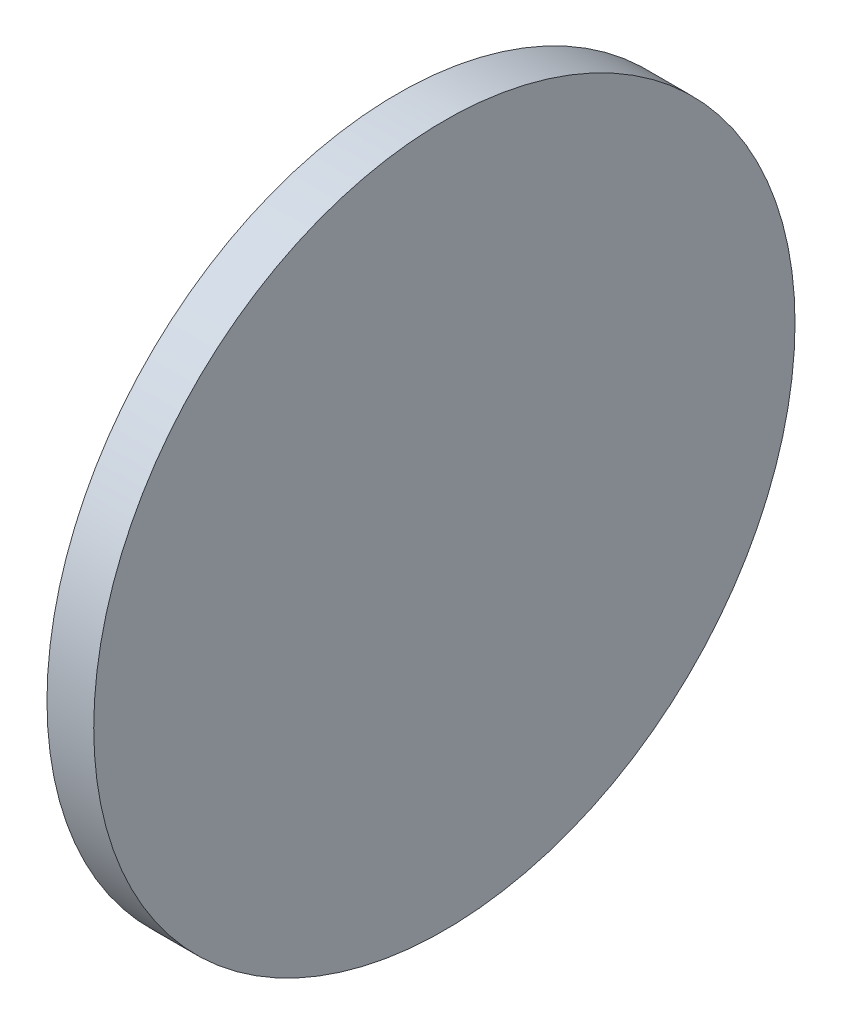
ISO-10303-21;
HEADER;
FILE_DESCRIPTION(('STEP AP214'),'2;1');
FILE_NAME('part.step','',(''),(''),'','','');
FILE_SCHEMA(('AUTOMOTIVE_DESIGN { 1 0 10303 214 1 1 1 1 }'));
ENDSEC;
DATA;
#1=APPLICATION_CONTEXT('core data for automotive mechanical design processes');
#2=APPLICATION_PROTOCOL_DEFINITION('international standard','automotive_design',2000,#1);
#3=PRODUCT_CONTEXT('',#1,'mechanical');
#4=PRODUCT('Part','Part','',(#3));
#5=PRODUCT_RELATED_PRODUCT_CATEGORY('part','',(#4));
#6=PRODUCT_DEFINITION_FORMATION('','',#4);
#7=PRODUCT_DEFINITION_CONTEXT('part definition',#1,'design');
#8=PRODUCT_DEFINITION('design','',#6,#7);
#9=PRODUCT_DEFINITION_SHAPE('','',#8);
#10=(LENGTH_UNIT() NAMED_UNIT(*) SI_UNIT(.MILLI.,.METRE.));
#11=(NAMED_UNIT(*) PLANE_ANGLE_UNIT() SI_UNIT($,.RADIAN.));
#12=(NAMED_UNIT(*) SI_UNIT($,.STERADIAN.) SOLID_ANGLE_UNIT());
#13=UNCERTAINTY_MEASURE_WITH_UNIT(LENGTH_MEASURE(1.E-05),#10,'distance_accuracy_value','');
#14=(GEOMETRIC_REPRESENTATION_CONTEXT(3) GLOBAL_UNCERTAINTY_ASSIGNED_CONTEXT((#13)) GLOBAL_UNIT_ASSIGNED_CONTEXT((#10,
#11,#12)) REPRESENTATION_CONTEXT('',''));
#15=CARTESIAN_POINT('',(0.,0.,0.));
#16=DIRECTION('',(0.,0.,1.));
#17=DIRECTION('',(1.,0.,0.));
#18=AXIS2_PLACEMENT_3D('',#15,#16,#17);
#19=CARTESIAN_POINT('',(1.,0.,0.));
#20=DIRECTION('',(-1.,0.,0.));
#21=DIRECTION('',(0.,0.,1.));
#22=AXIS2_PLACEMENT_3D('',#19,#20,#21);
#23=CYLINDRICAL_SURFACE('',#22,7.5);
#24=CARTESIAN_POINT('',(1.,0.,0.));
#25=DIRECTION('',(1.,0.,0.));
#26=DIRECTION('',(0.,0.,-1.));
#27=AXIS2_PLACEMENT_3D('',#24,#25,#26);
#28=CIRCLE('',#27,7.5);
#29=CARTESIAN_POINT('',(1.,0.,-7.5));
#30=VERTEX_POINT('',#29);
#31=EDGE_CURVE('E10',#30,#30,#28,.T.);
#32=ORIENTED_EDGE('',*,*,#31,.F.);
#33=EDGE_LOOP('',(#32));
#34=FACE_BOUND('',#33,.T.);
#35=CARTESIAN_POINT('',(0.,0.,0.));
#36=DIRECTION('',(1.,0.,0.));
#37=DIRECTION('',(0.,0.,-1.));
#38=AXIS2_PLACEMENT_3D('',#35,#36,#37);
#39=CIRCLE('',#38,7.5);
#40=CARTESIAN_POINT('',(0.,0.,-7.5));
#41=VERTEX_POINT('',#40);
#42=EDGE_CURVE('E40',#41,#41,#39,.T.);
#43=ORIENTED_EDGE('',*,*,#42,.T.);
#44=EDGE_LOOP('',(#43));
#45=FACE_BOUND('',#44,.T.);
#46=ADVANCED_FACE('F37',(#34,#45),#23,.T.);
#47=CARTESIAN_POINT('',(1.,0.,0.));
#48=DIRECTION('',(1.,0.,0.));
#49=DIRECTION('',(0.,0.,-1.));
#50=AXIS2_PLACEMENT_3D('',#47,#48,#49);
#51=PLANE('',#50);
#52=ORIENTED_EDGE('',*,*,#31,.T.);
#53=EDGE_LOOP('',(#52));
#54=FACE_BOUND('',#53,.T.);
#55=ADVANCED_FACE('F54',(#54),#51,.T.);
#56=CARTESIAN_POINT('',(0.,0.,0.));
#57=DIRECTION('',(1.,0.,0.));
#58=DIRECTION('',(0.,0.,-1.));
#59=AXIS2_PLACEMENT_3D('',#56,#57,#58);
#60=PLANE('',#59);
#61=ORIENTED_EDGE('',*,*,#42,.F.);
#62=EDGE_LOOP('',(#61));
#63=FACE_BOUND('',#62,.T.);
#64=ADVANCED_FACE('F52',(#63),#60,.F.);
#65=CLOSED_SHELL('',(#46,#55,#64));
#66=MANIFOLD_SOLID_BREP('B2',#65);
#67=ADVANCED_BREP_SHAPE_REPRESENTATION('',(#18,#66),#14);
#68=SHAPE_DEFINITION_REPRESENTATION(#9,#67);
ENDSEC;
END-ISO-10303-21;
